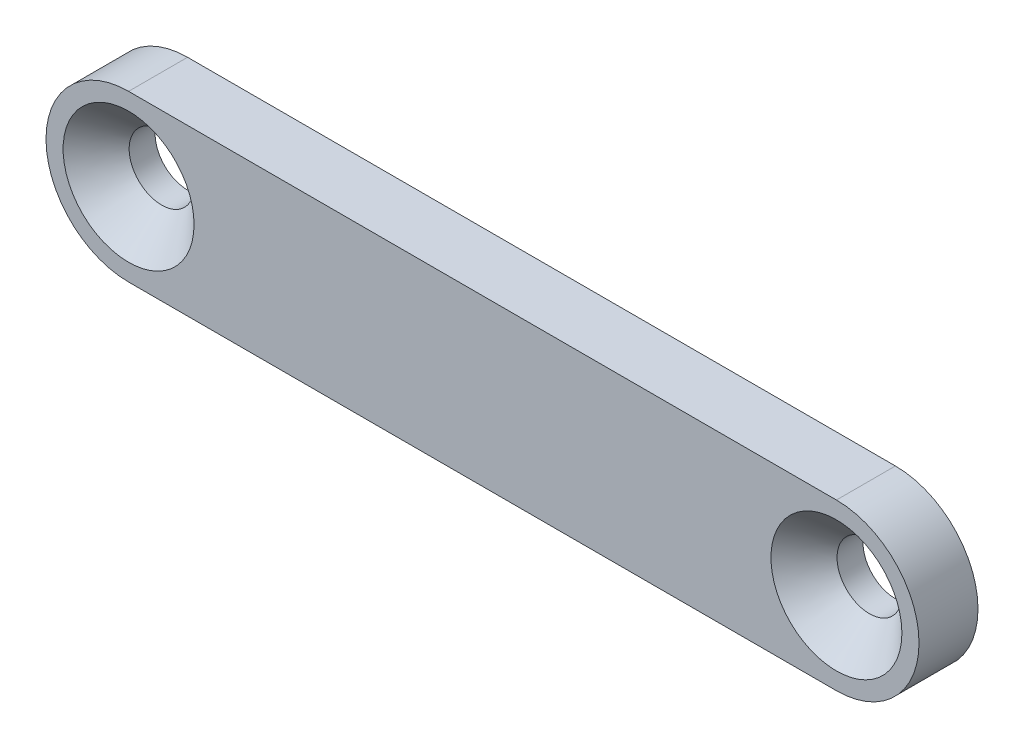
ISO-10303-21;
HEADER;
FILE_DESCRIPTION(('STEP AP214'),'2;1');
FILE_NAME('part.step','',(''),(''),'','','');
FILE_SCHEMA(('AUTOMOTIVE_DESIGN { 1 0 10303 214 1 1 1 1 }'));
ENDSEC;
DATA;
#1=APPLICATION_CONTEXT('core data for automotive mechanical design processes');
#2=APPLICATION_PROTOCOL_DEFINITION('international standard','automotive_design',2000,#1);
#3=PRODUCT_CONTEXT('',#1,'mechanical');
#4=PRODUCT('Part','Part','',(#3));
#5=PRODUCT_RELATED_PRODUCT_CATEGORY('part','',(#4));
#6=PRODUCT_DEFINITION_FORMATION('','',#4);
#7=PRODUCT_DEFINITION_CONTEXT('part definition',#1,'design');
#8=PRODUCT_DEFINITION('design','',#6,#7);
#9=PRODUCT_DEFINITION_SHAPE('','',#8);
#10=(LENGTH_UNIT() NAMED_UNIT(*) SI_UNIT(.MILLI.,.METRE.));
#11=(NAMED_UNIT(*) PLANE_ANGLE_UNIT() SI_UNIT($,.RADIAN.));
#12=(NAMED_UNIT(*) SI_UNIT($,.STERADIAN.) SOLID_ANGLE_UNIT());
#13=UNCERTAINTY_MEASURE_WITH_UNIT(LENGTH_MEASURE(1.E-05),#10,'distance_accuracy_value','');
#14=(GEOMETRIC_REPRESENTATION_CONTEXT(3) GLOBAL_UNCERTAINTY_ASSIGNED_CONTEXT((#13)) GLOBAL_UNIT_ASSIGNED_CONTEXT((#10,
#11,#12)) REPRESENTATION_CONTEXT('',''));
#15=CARTESIAN_POINT('',(0.,0.,0.));
#16=DIRECTION('',(0.,0.,1.));
#17=DIRECTION('',(1.,0.,0.));
#18=AXIS2_PLACEMENT_3D('',#15,#16,#17);
#19=CARTESIAN_POINT('',(0.,0.,5.));
#20=DIRECTION('',(0.,0.,1.));
#21=DIRECTION('',(1.,0.,0.));
#22=AXIS2_PLACEMENT_3D('',#19,#20,#21);
#23=PLANE('',#22);
#24=CARTESIAN_POINT('',(60.,0.,5.));
#25=DIRECTION('',(0.,0.,1.));
#26=DIRECTION('',(1.,0.,0.));
#27=AXIS2_PLACEMENT_3D('',#24,#25,#26);
#28=CIRCLE('',#27,5.55000000000001);
#29=CARTESIAN_POINT('',(65.55,0.,5.));
#30=VERTEX_POINT('',#29);
#31=EDGE_CURVE('E48',#30,#30,#28,.F.);
#32=ORIENTED_EDGE('',*,*,#31,.T.);
#33=EDGE_LOOP('',(#32));
#34=FACE_BOUND('',#33,.T.);
#35=CARTESIAN_POINT('',(0.,0.,5.));
#36=DIRECTION('',(0.,0.,1.));
#37=DIRECTION('',(1.,0.,0.));
#38=AXIS2_PLACEMENT_3D('',#35,#36,#37);
#39=CIRCLE('',#38,5.55000000000001);
#40=CARTESIAN_POINT('',(5.55000000000001,0.,5.));
#41=VERTEX_POINT('',#40);
#42=EDGE_CURVE('E119',#41,#41,#39,.F.);
#43=ORIENTED_EDGE('',*,*,#42,.T.);
#44=EDGE_LOOP('',(#43));
#45=FACE_BOUND('',#44,.T.);
#46=CARTESIAN_POINT('',(0.,0.,5.));
#47=DIRECTION('',(0.,0.,1.));
#48=DIRECTION('',(1.,0.,0.));
#49=AXIS2_PLACEMENT_3D('',#46,#47,#48);
#50=CIRCLE('',#49,7.);
#51=CARTESIAN_POINT('',(0.,7.,5.));
#52=VERTEX_POINT('',#51);
#53=CARTESIAN_POINT('',(0.,-7.,5.));
#54=VERTEX_POINT('',#53);
#55=EDGE_CURVE('E91',#52,#54,#50,.T.);
#56=ORIENTED_EDGE('',*,*,#55,.T.);
#57=DIRECTION('',(1.,0.,0.));
#58=VECTOR('',#57,1.);
#59=CARTESIAN_POINT('',(0.,-7.,5.));
#60=LINE('',#59,#58);
#61=CARTESIAN_POINT('',(60.,-7.,5.));
#62=VERTEX_POINT('',#61);
#63=EDGE_CURVE('E87',#54,#62,#60,.T.);
#64=ORIENTED_EDGE('',*,*,#63,.T.);
#65=CARTESIAN_POINT('',(60.,0.,5.));
#66=DIRECTION('',(0.,0.,1.));
#67=DIRECTION('',(1.,0.,0.));
#68=AXIS2_PLACEMENT_3D('',#65,#66,#67);
#69=CIRCLE('',#68,7.);
#70=CARTESIAN_POINT('',(60.,7.,5.));
#71=VERTEX_POINT('',#70);
#72=EDGE_CURVE('E89',#62,#71,#69,.T.);
#73=ORIENTED_EDGE('',*,*,#72,.T.);
#74=DIRECTION('',(-1.,0.,0.));
#75=VECTOR('',#74,1.);
#76=CARTESIAN_POINT('',(0.,7.,5.));
#77=LINE('',#76,#75);
#78=EDGE_CURVE('E56',#71,#52,#77,.T.);
#79=ORIENTED_EDGE('',*,*,#78,.T.);
#80=EDGE_LOOP('',(#56,#64,#73,#79));
#81=FACE_BOUND('',#80,.T.);
#82=ADVANCED_FACE('F39',(#34,#45,#81),#23,.T.);
#83=CARTESIAN_POINT('',(0.,0.,0.));
#84=DIRECTION('',(0.,0.,1.));
#85=DIRECTION('',(1.,0.,0.));
#86=AXIS2_PLACEMENT_3D('',#83,#84,#85);
#87=PLANE('',#86);
#88=CARTESIAN_POINT('',(0.,0.,0.));
#89=DIRECTION('',(0.,0.,1.));
#90=DIRECTION('',(1.,0.,0.));
#91=AXIS2_PLACEMENT_3D('',#88,#89,#90);
#92=CIRCLE('',#91,7.);
#93=CARTESIAN_POINT('',(0.,7.,0.));
#94=VERTEX_POINT('',#93);
#95=CARTESIAN_POINT('',(0.,-7.,0.));
#96=VERTEX_POINT('',#95);
#97=EDGE_CURVE('E106',#94,#96,#92,.T.);
#98=ORIENTED_EDGE('',*,*,#97,.F.);
#99=DIRECTION('',(-1.,0.,0.));
#100=VECTOR('',#99,1.);
#101=CARTESIAN_POINT('',(0.,7.,0.));
#102=LINE('',#101,#100);
#103=CARTESIAN_POINT('',(60.,7.,0.));
#104=VERTEX_POINT('',#103);
#105=EDGE_CURVE('E79',#104,#94,#102,.T.);
#106=ORIENTED_EDGE('',*,*,#105,.F.);
#107=CARTESIAN_POINT('',(60.,0.,0.));
#108=DIRECTION('',(0.,0.,1.));
#109=DIRECTION('',(1.,0.,0.));
#110=AXIS2_PLACEMENT_3D('',#107,#108,#109);
#111=CIRCLE('',#110,7.);
#112=CARTESIAN_POINT('',(60.,-7.,0.));
#113=VERTEX_POINT('',#112);
#114=EDGE_CURVE('E73',#113,#104,#111,.T.);
#115=ORIENTED_EDGE('',*,*,#114,.F.);
#116=DIRECTION('',(1.,0.,0.));
#117=VECTOR('',#116,1.);
#118=CARTESIAN_POINT('',(0.,-7.,0.));
#119=LINE('',#118,#117);
#120=EDGE_CURVE('E96',#96,#113,#119,.T.);
#121=ORIENTED_EDGE('',*,*,#120,.F.);
#122=EDGE_LOOP('',(#98,#106,#115,#121));
#123=FACE_BOUND('',#122,.T.);
#124=CARTESIAN_POINT('',(60.,0.,0.));
#125=DIRECTION('',(0.,0.,1.));
#126=DIRECTION('',(1.,0.,0.));
#127=AXIS2_PLACEMENT_3D('',#124,#125,#126);
#128=CIRCLE('',#127,2.75000000000001);
#129=CARTESIAN_POINT('',(62.75,0.,0.));
#130=VERTEX_POINT('',#129);
#131=EDGE_CURVE('E109',#130,#130,#128,.T.);
#132=ORIENTED_EDGE('',*,*,#131,.T.);
#133=EDGE_LOOP('',(#132));
#134=FACE_BOUND('',#133,.T.);
#135=CARTESIAN_POINT('',(0.,0.,0.));
#136=DIRECTION('',(0.,0.,1.));
#137=DIRECTION('',(1.,0.,0.));
#138=AXIS2_PLACEMENT_3D('',#135,#136,#137);
#139=CIRCLE('',#138,2.75);
#140=CARTESIAN_POINT('',(2.75,0.,0.));
#141=VERTEX_POINT('',#140);
#142=EDGE_CURVE('E140',#141,#141,#139,.T.);
#143=ORIENTED_EDGE('',*,*,#142,.T.);
#144=EDGE_LOOP('',(#143));
#145=FACE_BOUND('',#144,.T.);
#146=ADVANCED_FACE('F146',(#123,#134,#145),#87,.F.);
#147=CARTESIAN_POINT('',(0.,0.,5.));
#148=DIRECTION('',(0.,0.,-1.));
#149=DIRECTION('',(-1.,0.,0.));
#150=AXIS2_PLACEMENT_3D('',#147,#148,#149);
#151=CYLINDRICAL_SURFACE('',#150,7.);
#152=ORIENTED_EDGE('',*,*,#97,.T.);
#153=DIRECTION('',(0.,0.,-1.));
#154=VECTOR('',#153,1.);
#155=CARTESIAN_POINT('',(0.,-7.,5.));
#156=LINE('',#155,#154);
#157=EDGE_CURVE('E97',#54,#96,#156,.T.);
#158=ORIENTED_EDGE('',*,*,#157,.F.);
#159=ORIENTED_EDGE('',*,*,#55,.F.);
#160=DIRECTION('',(0.,0.,-1.));
#161=VECTOR('',#160,1.);
#162=CARTESIAN_POINT('',(0.,7.,5.));
#163=LINE('',#162,#161);
#164=EDGE_CURVE('E102',#52,#94,#163,.T.);
#165=ORIENTED_EDGE('',*,*,#164,.T.);
#166=EDGE_LOOP('',(#152,#158,#159,#165));
#167=FACE_BOUND('',#166,.T.);
#168=ADVANCED_FACE('F158',(#167),#151,.T.);
#169=CARTESIAN_POINT('',(0.,-7.,5.));
#170=DIRECTION('',(0.,1.,0.));
#171=DIRECTION('',(0.,0.,1.));
#172=AXIS2_PLACEMENT_3D('',#169,#170,#171);
#173=PLANE('',#172);
#174=ORIENTED_EDGE('',*,*,#120,.T.);
#175=DIRECTION('',(0.,0.,-1.));
#176=VECTOR('',#175,1.);
#177=CARTESIAN_POINT('',(60.,-7.,5.));
#178=LINE('',#177,#176);
#179=EDGE_CURVE('E94',#62,#113,#178,.T.);
#180=ORIENTED_EDGE('',*,*,#179,.F.);
#181=ORIENTED_EDGE('',*,*,#63,.F.);
#182=ORIENTED_EDGE('',*,*,#157,.T.);
#183=EDGE_LOOP('',(#174,#180,#181,#182));
#184=FACE_BOUND('',#183,.T.);
#185=ADVANCED_FACE('F95',(#184),#173,.F.);
#186=CARTESIAN_POINT('',(60.,0.,5.));
#187=DIRECTION('',(0.,0.,-1.));
#188=DIRECTION('',(-1.,0.,0.));
#189=AXIS2_PLACEMENT_3D('',#186,#187,#188);
#190=CYLINDRICAL_SURFACE('',#189,7.);
#191=ORIENTED_EDGE('',*,*,#114,.T.);
#192=DIRECTION('',(0.,0.,-1.));
#193=VECTOR('',#192,1.);
#194=CARTESIAN_POINT('',(60.,7.,5.));
#195=LINE('',#194,#193);
#196=EDGE_CURVE('E98',#71,#104,#195,.T.);
#197=ORIENTED_EDGE('',*,*,#196,.F.);
#198=ORIENTED_EDGE('',*,*,#72,.F.);
#199=ORIENTED_EDGE('',*,*,#179,.T.);
#200=EDGE_LOOP('',(#191,#197,#198,#199));
#201=FACE_BOUND('',#200,.T.);
#202=ADVANCED_FACE('F100',(#201),#190,.T.);
#203=CARTESIAN_POINT('',(0.,7.,5.));
#204=DIRECTION('',(0.,-1.,0.));
#205=DIRECTION('',(0.,0.,-1.));
#206=AXIS2_PLACEMENT_3D('',#203,#204,#205);
#207=PLANE('',#206);
#208=ORIENTED_EDGE('',*,*,#105,.T.);
#209=ORIENTED_EDGE('',*,*,#164,.F.);
#210=ORIENTED_EDGE('',*,*,#78,.F.);
#211=ORIENTED_EDGE('',*,*,#196,.T.);
#212=EDGE_LOOP('',(#208,#209,#210,#211));
#213=FACE_BOUND('',#212,.T.);
#214=ADVANCED_FACE('F135',(#213),#207,.F.);
#215=CARTESIAN_POINT('',(60.,0.,5.));
#216=DIRECTION('',(0.,0.,-1.));
#217=DIRECTION('',(-1.,0.,0.));
#218=AXIS2_PLACEMENT_3D('',#215,#216,#217);
#219=CYLINDRICAL_SURFACE('',#218,2.75000000000001);
#220=CARTESIAN_POINT('',(60.,0.,2.20000000000001));
#221=DIRECTION('',(0.,0.,1.));
#222=DIRECTION('',(1.,0.,0.));
#223=AXIS2_PLACEMENT_3D('',#220,#221,#222);
#224=CIRCLE('',#223,2.75000000000001);
#225=CARTESIAN_POINT('',(62.75,0.,2.20000000000001));
#226=VERTEX_POINT('',#225);
#227=EDGE_CURVE('E116',#226,#226,#224,.T.);
#228=ORIENTED_EDGE('',*,*,#227,.T.);
#229=EDGE_LOOP('',(#228));
#230=FACE_BOUND('',#229,.T.);
#231=ORIENTED_EDGE('',*,*,#131,.F.);
#232=EDGE_LOOP('',(#231));
#233=FACE_BOUND('',#232,.T.);
#234=ADVANCED_FACE('F132',(#230,#233),#219,.F.);
#235=CARTESIAN_POINT('',(0.,0.,5.));
#236=DIRECTION('',(0.,0.,-1.));
#237=DIRECTION('',(-1.,0.,0.));
#238=AXIS2_PLACEMENT_3D('',#235,#236,#237);
#239=CYLINDRICAL_SURFACE('',#238,2.75);
#240=CARTESIAN_POINT('',(0.,0.,2.2));
#241=DIRECTION('',(0.,0.,1.));
#242=DIRECTION('',(1.,0.,0.));
#243=AXIS2_PLACEMENT_3D('',#240,#241,#242);
#244=CIRCLE('',#243,2.75);
#245=CARTESIAN_POINT('',(2.75,0.,2.2));
#246=VERTEX_POINT('',#245);
#247=EDGE_CURVE('E11',#246,#246,#244,.T.);
#248=ORIENTED_EDGE('',*,*,#247,.T.);
#249=EDGE_LOOP('',(#248));
#250=FACE_BOUND('',#249,.T.);
#251=ORIENTED_EDGE('',*,*,#142,.F.);
#252=EDGE_LOOP('',(#251));
#253=FACE_BOUND('',#252,.T.);
#254=ADVANCED_FACE('F129',(#250,#253),#239,.F.);
#255=CARTESIAN_POINT('',(60.,0.,2.20000000000001));
#256=DIRECTION('',(0.,0.,1.));
#257=DIRECTION('',(1.,0.,0.));
#258=AXIS2_PLACEMENT_3D('',#255,#256,#257);
#259=CONICAL_SURFACE('',#258,2.75000000000001,0.78539816339745);
#260=ORIENTED_EDGE('',*,*,#31,.F.);
#261=EDGE_LOOP('',(#260));
#262=FACE_BOUND('',#261,.T.);
#263=ORIENTED_EDGE('',*,*,#227,.F.);
#264=EDGE_LOOP('',(#263));
#265=FACE_BOUND('',#264,.T.);
#266=ADVANCED_FACE('F126',(#262,#265),#259,.F.);
#267=CARTESIAN_POINT('',(0.,0.,2.2));
#268=DIRECTION('',(0.,0.,1.));
#269=DIRECTION('',(1.,0.,0.));
#270=AXIS2_PLACEMENT_3D('',#267,#268,#269);
#271=CONICAL_SURFACE('',#270,2.75,0.78539816339745);
#272=ORIENTED_EDGE('',*,*,#42,.F.);
#273=EDGE_LOOP('',(#272));
#274=FACE_BOUND('',#273,.T.);
#275=ORIENTED_EDGE('',*,*,#247,.F.);
#276=EDGE_LOOP('',(#275));
#277=FACE_BOUND('',#276,.T.);
#278=ADVANCED_FACE('F41',(#274,#277),#271,.F.);
#279=CLOSED_SHELL('',(#82,#146,#168,#185,#202,#214,#234,#254,#266,#278));
#280=MANIFOLD_SOLID_BREP('B2',#279);
#281=ADVANCED_BREP_SHAPE_REPRESENTATION('',(#18,#280),#14);
#282=SHAPE_DEFINITION_REPRESENTATION(#9,#281);
ENDSEC;
END-ISO-10303-21;
